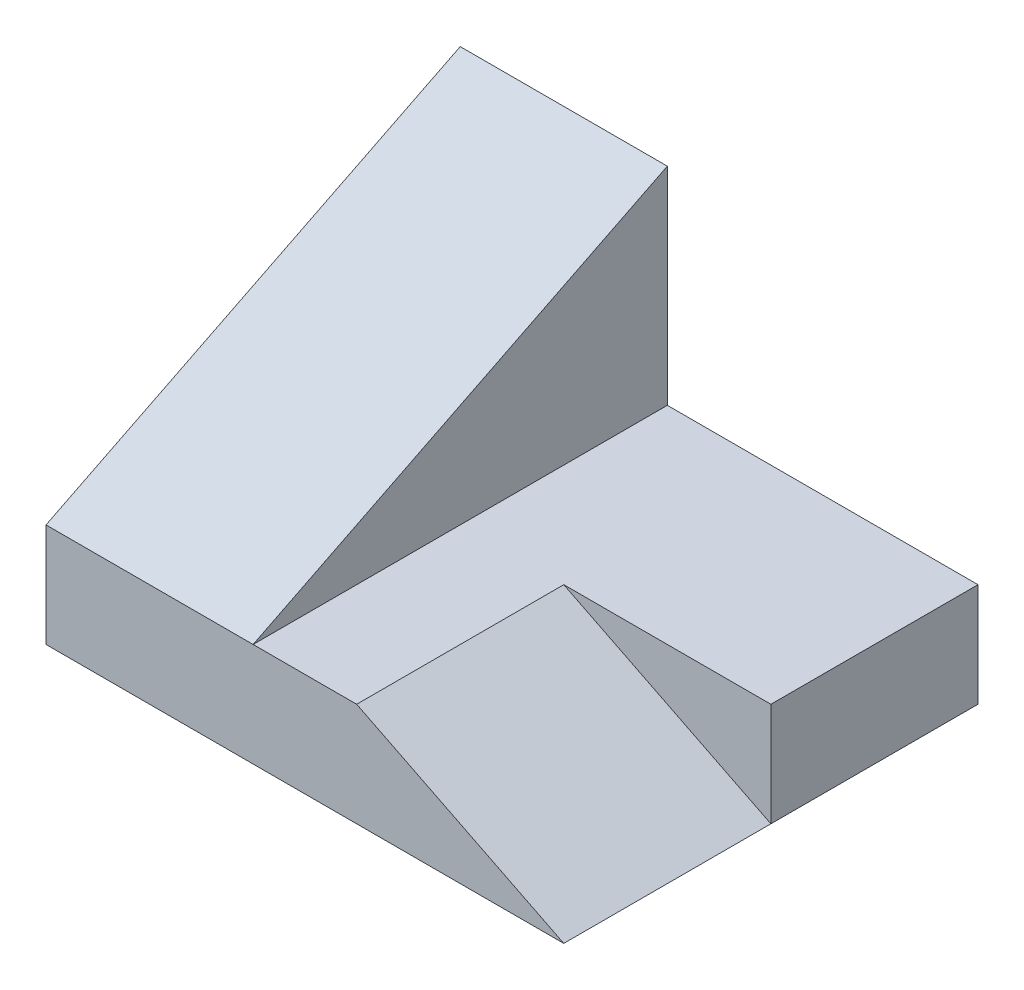
ISO-10303-21;
HEADER;
FILE_DESCRIPTION(('STEP AP214'),'2;1');
FILE_NAME('part.step','',(''),(''),'','','');
FILE_SCHEMA(('AUTOMOTIVE_DESIGN { 1 0 10303 214 1 1 1 1 }'));
ENDSEC;
DATA;
#1=APPLICATION_CONTEXT('core data for automotive mechanical design processes');
#2=APPLICATION_PROTOCOL_DEFINITION('international standard','automotive_design',2000,#1);
#3=PRODUCT_CONTEXT('',#1,'mechanical');
#4=PRODUCT('Part','Part','',(#3));
#5=PRODUCT_RELATED_PRODUCT_CATEGORY('part','',(#4));
#6=PRODUCT_DEFINITION_FORMATION('','',#4);
#7=PRODUCT_DEFINITION_CONTEXT('part definition',#1,'design');
#8=PRODUCT_DEFINITION('design','',#6,#7);
#9=PRODUCT_DEFINITION_SHAPE('','',#8);
#10=(LENGTH_UNIT() NAMED_UNIT(*) SI_UNIT(.MILLI.,.METRE.));
#11=(NAMED_UNIT(*) PLANE_ANGLE_UNIT() SI_UNIT($,.RADIAN.));
#12=(NAMED_UNIT(*) SI_UNIT($,.STERADIAN.) SOLID_ANGLE_UNIT());
#13=UNCERTAINTY_MEASURE_WITH_UNIT(LENGTH_MEASURE(1.E-05),#10,'distance_accuracy_value','');
#14=(GEOMETRIC_REPRESENTATION_CONTEXT(3) GLOBAL_UNCERTAINTY_ASSIGNED_CONTEXT((#13)) GLOBAL_UNIT_ASSIGNED_CONTEXT((#10,
#11,#12)) REPRESENTATION_CONTEXT('',''));
#15=CARTESIAN_POINT('',(0.,0.,0.));
#16=DIRECTION('',(0.,0.,1.));
#17=DIRECTION('',(1.,0.,0.));
#18=AXIS2_PLACEMENT_3D('',#15,#16,#17);
#19=CARTESIAN_POINT('',(50.,30.,0.));
#20=DIRECTION('',(-1.,0.,0.));
#21=DIRECTION('',(0.,0.,1.));
#22=AXIS2_PLACEMENT_3D('',#19,#20,#21);
#23=PLANE('',#22);
#24=DIRECTION('',(0.,1.,0.));
#25=VECTOR('',#24,1.);
#26=CARTESIAN_POINT('',(50.,10.,-20.));
#27=LINE('',#26,#25);
#28=CARTESIAN_POINT('',(50.,0.,-20.));
#29=VERTEX_POINT('',#28);
#30=CARTESIAN_POINT('',(50.,10.,-20.));
#31=VERTEX_POINT('',#30);
#32=EDGE_CURVE('E48',#29,#31,#27,.T.);
#33=ORIENTED_EDGE('',*,*,#32,.F.);
#34=DIRECTION('',(0.,0.,-1.));
#35=VECTOR('',#34,1.);
#36=CARTESIAN_POINT('',(50.,0.,0.));
#37=LINE('',#36,#35);
#38=CARTESIAN_POINT('',(50.,0.,-40.));
#39=VERTEX_POINT('',#38);
#40=EDGE_CURVE('E142',#29,#39,#37,.T.);
#41=ORIENTED_EDGE('',*,*,#40,.T.);
#42=DIRECTION('',(0.,-1.,0.));
#43=VECTOR('',#42,1.);
#44=CARTESIAN_POINT('',(50.,30.,-40.));
#45=LINE('',#44,#43);
#46=CARTESIAN_POINT('',(50.,10.,-40.));
#47=VERTEX_POINT('',#46);
#48=EDGE_CURVE('E41',#47,#39,#45,.T.);
#49=ORIENTED_EDGE('',*,*,#48,.F.);
#50=DIRECTION('',(0.,0.,-1.));
#51=VECTOR('',#50,1.);
#52=CARTESIAN_POINT('',(50.,10.,-40.));
#53=LINE('',#52,#51);
#54=EDGE_CURVE('E122',#31,#47,#53,.T.);
#55=ORIENTED_EDGE('',*,*,#54,.F.);
#56=EDGE_LOOP('',(#33,#41,#49,#55));
#57=FACE_BOUND('',#56,.T.);
#58=ADVANCED_FACE('F33',(#57),#23,.F.);
#59=CARTESIAN_POINT('',(0.,30.,-40.));
#60=DIRECTION('',(1.,0.,0.));
#61=DIRECTION('',(0.,0.,-1.));
#62=AXIS2_PLACEMENT_3D('',#59,#60,#61);
#63=PLANE('',#62);
#64=DIRECTION('',(0.,-1.,0.));
#65=VECTOR('',#64,1.);
#66=CARTESIAN_POINT('',(0.,30.,0.));
#67=LINE('',#66,#65);
#68=CARTESIAN_POINT('',(0.,10.,0.));
#69=VERTEX_POINT('',#68);
#70=CARTESIAN_POINT('',(0.,0.,0.));
#71=VERTEX_POINT('',#70);
#72=EDGE_CURVE('E11',#69,#71,#67,.T.);
#73=ORIENTED_EDGE('',*,*,#72,.F.);
#74=DIRECTION('',(0.,0.447213595499958,-0.894427190999916));
#75=VECTOR('',#74,1.);
#76=CARTESIAN_POINT('',(0.,30.,-40.));
#77=LINE('',#76,#75);
#78=CARTESIAN_POINT('',(0.,30.,-40.));
#79=VERTEX_POINT('',#78);
#80=EDGE_CURVE('E113',#69,#79,#77,.T.);
#81=ORIENTED_EDGE('',*,*,#80,.T.);
#82=DIRECTION('',(0.,-1.,0.));
#83=VECTOR('',#82,1.);
#84=CARTESIAN_POINT('',(0.,30.,-40.));
#85=LINE('',#84,#83);
#86=CARTESIAN_POINT('',(0.,0.,-40.));
#87=VERTEX_POINT('',#86);
#88=EDGE_CURVE('E136',#79,#87,#85,.T.);
#89=ORIENTED_EDGE('',*,*,#88,.T.);
#90=DIRECTION('',(0.,0.,1.));
#91=VECTOR('',#90,1.);
#92=CARTESIAN_POINT('',(0.,0.,-40.));
#93=LINE('',#92,#91);
#94=EDGE_CURVE('E133',#87,#71,#93,.T.);
#95=ORIENTED_EDGE('',*,*,#94,.T.);
#96=EDGE_LOOP('',(#73,#81,#89,#95));
#97=FACE_BOUND('',#96,.T.);
#98=ADVANCED_FACE('F35',(#97),#63,.F.);
#99=CARTESIAN_POINT('',(0.,30.,0.));
#100=DIRECTION('',(0.,0.,-1.));
#101=DIRECTION('',(-1.,0.,0.));
#102=AXIS2_PLACEMENT_3D('',#99,#100,#101);
#103=PLANE('',#102);
#104=DIRECTION('',(1.,0.,0.));
#105=VECTOR('',#104,1.);
#106=CARTESIAN_POINT('',(0.,0.,0.));
#107=LINE('',#106,#105);
#108=CARTESIAN_POINT('',(50.,0.,0.));
#109=VERTEX_POINT('',#108);
#110=EDGE_CURVE('E139',#71,#109,#107,.T.);
#111=ORIENTED_EDGE('',*,*,#110,.T.);
#112=DIRECTION('',(0.894427190999916,-0.447213595499958,0.));
#113=VECTOR('',#112,1.);
#114=CARTESIAN_POINT('',(50.,0.,0.));
#115=LINE('',#114,#113);
#116=CARTESIAN_POINT('',(30.,10.,0.));
#117=VERTEX_POINT('',#116);
#118=EDGE_CURVE('E117',#117,#109,#115,.T.);
#119=ORIENTED_EDGE('',*,*,#118,.F.);
#120=DIRECTION('',(1.,0.,0.));
#121=VECTOR('',#120,1.);
#122=CARTESIAN_POINT('',(50.,10.,0.));
#123=LINE('',#122,#121);
#124=CARTESIAN_POINT('',(20.,10.,0.));
#125=VERTEX_POINT('',#124);
#126=EDGE_CURVE('E110',#125,#117,#123,.T.);
#127=ORIENTED_EDGE('',*,*,#126,.F.);
#128=DIRECTION('',(1.,0.,0.));
#129=VECTOR('',#128,1.);
#130=CARTESIAN_POINT('',(0.,10.,0.));
#131=LINE('',#130,#129);
#132=EDGE_CURVE('E119',#69,#125,#131,.T.);
#133=ORIENTED_EDGE('',*,*,#132,.F.);
#134=ORIENTED_EDGE('',*,*,#72,.T.);
#135=EDGE_LOOP('',(#111,#119,#127,#133,#134));
#136=FACE_BOUND('',#135,.T.);
#137=ADVANCED_FACE('F166',(#136),#103,.F.);
#138=CARTESIAN_POINT('',(50.,30.,-40.));
#139=DIRECTION('',(0.,0.,1.));
#140=DIRECTION('',(1.,0.,0.));
#141=AXIS2_PLACEMENT_3D('',#138,#139,#140);
#142=PLANE('',#141);
#143=DIRECTION('',(-1.,0.,0.));
#144=VECTOR('',#143,1.);
#145=CARTESIAN_POINT('',(50.,30.,-40.));
#146=LINE('',#145,#144);
#147=CARTESIAN_POINT('',(20.,30.,-40.));
#148=VERTEX_POINT('',#147);
#149=EDGE_CURVE('E134',#148,#79,#146,.T.);
#150=ORIENTED_EDGE('',*,*,#149,.F.);
#151=DIRECTION('',(0.,1.,0.));
#152=VECTOR('',#151,1.);
#153=CARTESIAN_POINT('',(20.,10.,-40.));
#154=LINE('',#153,#152);
#155=CARTESIAN_POINT('',(20.,10.,-40.));
#156=VERTEX_POINT('',#155);
#157=EDGE_CURVE('E130',#156,#148,#154,.T.);
#158=ORIENTED_EDGE('',*,*,#157,.F.);
#159=DIRECTION('',(-1.,0.,0.));
#160=VECTOR('',#159,1.);
#161=CARTESIAN_POINT('',(50.,10.,-40.));
#162=LINE('',#161,#160);
#163=EDGE_CURVE('E124',#47,#156,#162,.T.);
#164=ORIENTED_EDGE('',*,*,#163,.F.);
#165=ORIENTED_EDGE('',*,*,#48,.T.);
#166=DIRECTION('',(-1.,0.,0.));
#167=VECTOR('',#166,1.);
#168=CARTESIAN_POINT('',(50.,0.,-40.));
#169=LINE('',#168,#167);
#170=EDGE_CURVE('E56',#39,#87,#169,.T.);
#171=ORIENTED_EDGE('',*,*,#170,.T.);
#172=ORIENTED_EDGE('',*,*,#88,.F.);
#173=EDGE_LOOP('',(#150,#158,#164,#165,#171,#172));
#174=FACE_BOUND('',#173,.T.);
#175=ADVANCED_FACE('F148',(#174),#142,.F.);
#176=CARTESIAN_POINT('',(0.,0.,0.));
#177=DIRECTION('',(0.,1.,0.));
#178=DIRECTION('',(0.,0.,1.));
#179=AXIS2_PLACEMENT_3D('',#176,#177,#178);
#180=PLANE('',#179);
#181=ORIENTED_EDGE('',*,*,#94,.F.);
#182=ORIENTED_EDGE('',*,*,#170,.F.);
#183=ORIENTED_EDGE('',*,*,#40,.F.);
#184=EDGE_CURVE('E104',#109,#29,#37,.T.);
#185=ORIENTED_EDGE('',*,*,#184,.F.);
#186=ORIENTED_EDGE('',*,*,#110,.F.);
#187=EDGE_LOOP('',(#181,#182,#183,#185,#186));
#188=FACE_BOUND('',#187,.T.);
#189=ADVANCED_FACE('F154',(#188),#180,.F.);
#190=CARTESIAN_POINT('',(20.,10.,-40.));
#191=DIRECTION('',(-1.,0.,0.));
#192=DIRECTION('',(0.,0.,1.));
#193=AXIS2_PLACEMENT_3D('',#190,#191,#192);
#194=PLANE('',#193);
#195=ORIENTED_EDGE('',*,*,#157,.T.);
#196=DIRECTION('',(0.,0.447213595499958,-0.894427190999916));
#197=VECTOR('',#196,1.);
#198=CARTESIAN_POINT('',(20.,30.,-40.));
#199=LINE('',#198,#197);
#200=EDGE_CURVE('E111',#125,#148,#199,.T.);
#201=ORIENTED_EDGE('',*,*,#200,.F.);
#202=DIRECTION('',(0.,0.,1.));
#203=VECTOR('',#202,1.);
#204=CARTESIAN_POINT('',(20.,10.,-40.));
#205=LINE('',#204,#203);
#206=EDGE_CURVE('E127',#156,#125,#205,.T.);
#207=ORIENTED_EDGE('',*,*,#206,.F.);
#208=EDGE_LOOP('',(#195,#201,#207));
#209=FACE_BOUND('',#208,.T.);
#210=ADVANCED_FACE('F163',(#209),#194,.F.);
#211=CARTESIAN_POINT('',(0.,10.,0.));
#212=DIRECTION('',(0.,-1.,0.));
#213=DIRECTION('',(0.,0.,-1.));
#214=AXIS2_PLACEMENT_3D('',#211,#212,#213);
#215=PLANE('',#214);
#216=ORIENTED_EDGE('',*,*,#126,.T.);
#217=DIRECTION('',(0.,0.,1.));
#218=VECTOR('',#217,1.);
#219=CARTESIAN_POINT('',(30.,10.,-20.));
#220=LINE('',#219,#218);
#221=CARTESIAN_POINT('',(30.,10.,-20.));
#222=VERTEX_POINT('',#221);
#223=EDGE_CURVE('E101',#222,#117,#220,.T.);
#224=ORIENTED_EDGE('',*,*,#223,.F.);
#225=DIRECTION('',(-1.,0.,0.));
#226=VECTOR('',#225,1.);
#227=CARTESIAN_POINT('',(30.,10.,-20.));
#228=LINE('',#227,#226);
#229=EDGE_CURVE('E91',#31,#222,#228,.T.);
#230=ORIENTED_EDGE('',*,*,#229,.F.);
#231=ORIENTED_EDGE('',*,*,#54,.T.);
#232=ORIENTED_EDGE('',*,*,#163,.T.);
#233=ORIENTED_EDGE('',*,*,#206,.T.);
#234=EDGE_LOOP('',(#216,#224,#230,#231,#232,#233));
#235=FACE_BOUND('',#234,.T.);
#236=ADVANCED_FACE('F107',(#235),#215,.F.);
#237=CARTESIAN_POINT('',(0.,30.,-40.));
#238=DIRECTION('',(0.,-0.894427190999916,-0.447213595499958));
#239=DIRECTION('',(0.,0.447213595499958,-0.894427190999916));
#240=AXIS2_PLACEMENT_3D('',#237,#238,#239);
#241=PLANE('',#240);
#242=ORIENTED_EDGE('',*,*,#200,.T.);
#243=ORIENTED_EDGE('',*,*,#149,.T.);
#244=ORIENTED_EDGE('',*,*,#80,.F.);
#245=ORIENTED_EDGE('',*,*,#132,.T.);
#246=EDGE_LOOP('',(#242,#243,#244,#245));
#247=FACE_BOUND('',#246,.T.);
#248=ADVANCED_FACE('F159',(#247),#241,.F.);
#249=CARTESIAN_POINT('',(50.,0.,-20.));
#250=DIRECTION('',(-0.447213595499958,-0.894427190999916,0.));
#251=DIRECTION('',(0.894427190999916,-0.447213595499958,0.));
#252=AXIS2_PLACEMENT_3D('',#249,#250,#251);
#253=PLANE('',#252);
#254=ORIENTED_EDGE('',*,*,#118,.T.);
#255=ORIENTED_EDGE('',*,*,#184,.T.);
#256=DIRECTION('',(0.894427190999916,-0.447213595499958,0.));
#257=VECTOR('',#256,1.);
#258=CARTESIAN_POINT('',(50.,0.,-20.));
#259=LINE('',#258,#257);
#260=EDGE_CURVE('E94',#222,#29,#259,.T.);
#261=ORIENTED_EDGE('',*,*,#260,.F.);
#262=ORIENTED_EDGE('',*,*,#223,.T.);
#263=EDGE_LOOP('',(#254,#255,#261,#262));
#264=FACE_BOUND('',#263,.T.);
#265=ADVANCED_FACE('F100',(#264),#253,.F.);
#266=CARTESIAN_POINT('',(0.,0.,-20.));
#267=DIRECTION('',(0.,0.,1.));
#268=DIRECTION('',(1.,0.,0.));
#269=AXIS2_PLACEMENT_3D('',#266,#267,#268);
#270=PLANE('',#269);
#271=ORIENTED_EDGE('',*,*,#32,.T.);
#272=ORIENTED_EDGE('',*,*,#229,.T.);
#273=ORIENTED_EDGE('',*,*,#260,.T.);
#274=EDGE_LOOP('',(#271,#272,#273));
#275=FACE_BOUND('',#274,.T.);
#276=ADVANCED_FACE('F93',(#275),#270,.T.);
#277=CLOSED_SHELL('',(#58,#98,#137,#175,#189,#210,#236,#248,#265,#276));
#278=MANIFOLD_SOLID_BREP('B2',#277);
#279=ADVANCED_BREP_SHAPE_REPRESENTATION('',(#18,#278),#14);
#280=SHAPE_DEFINITION_REPRESENTATION(#9,#279);
ENDSEC;
END-ISO-10303-21;
